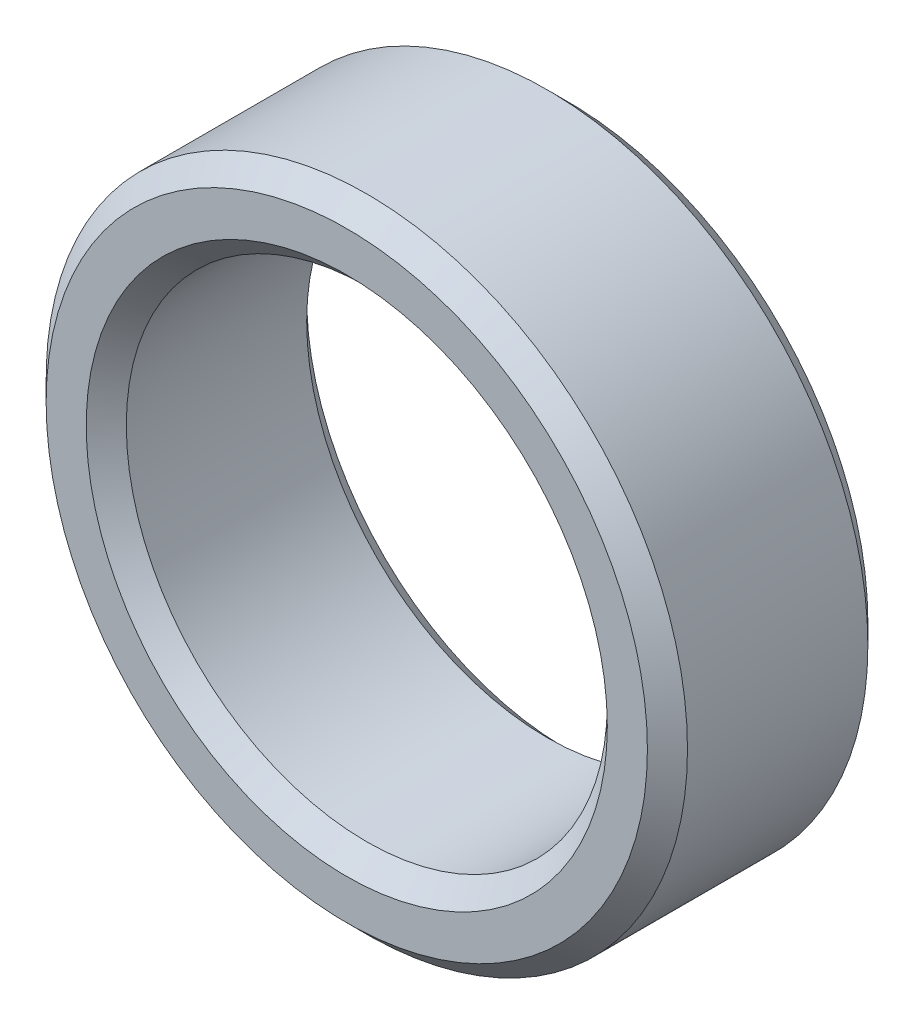
ISO-10303-21;
HEADER;
FILE_DESCRIPTION(('STEP AP214'),'2;1');
FILE_NAME('part.step','',(''),(''),'','','');
FILE_SCHEMA(('AUTOMOTIVE_DESIGN { 1 0 10303 214 1 1 1 1 }'));
ENDSEC;
DATA;
#1=APPLICATION_CONTEXT('core data for automotive mechanical design processes');
#2=APPLICATION_PROTOCOL_DEFINITION('international standard','automotive_design',2000,#1);
#3=PRODUCT_CONTEXT('',#1,'mechanical');
#4=PRODUCT('Part','Part','',(#3));
#5=PRODUCT_RELATED_PRODUCT_CATEGORY('part','',(#4));
#6=PRODUCT_DEFINITION_FORMATION('','',#4);
#7=PRODUCT_DEFINITION_CONTEXT('part definition',#1,'design');
#8=PRODUCT_DEFINITION('design','',#6,#7);
#9=PRODUCT_DEFINITION_SHAPE('','',#8);
#10=(LENGTH_UNIT() NAMED_UNIT(*) SI_UNIT(.MILLI.,.METRE.));
#11=(NAMED_UNIT(*) PLANE_ANGLE_UNIT() SI_UNIT($,.RADIAN.));
#12=(NAMED_UNIT(*) SI_UNIT($,.STERADIAN.) SOLID_ANGLE_UNIT());
#13=UNCERTAINTY_MEASURE_WITH_UNIT(LENGTH_MEASURE(1.E-05),#10,'distance_accuracy_value','');
#14=(GEOMETRIC_REPRESENTATION_CONTEXT(3) GLOBAL_UNCERTAINTY_ASSIGNED_CONTEXT((#13)) GLOBAL_UNIT_ASSIGNED_CONTEXT((#10,
#11,#12)) REPRESENTATION_CONTEXT('',''));
#15=CARTESIAN_POINT('',(0.,0.,0.));
#16=DIRECTION('',(0.,0.,1.));
#17=DIRECTION('',(1.,0.,0.));
#18=AXIS2_PLACEMENT_3D('',#15,#16,#17);
#19=CARTESIAN_POINT('',(0.,0.,5.5));
#20=DIRECTION('',(0.,0.,1.));
#21=DIRECTION('',(1.,0.,0.));
#22=AXIS2_PLACEMENT_3D('',#19,#20,#21);
#23=PLANE('',#22);
#24=CARTESIAN_POINT('',(0.,0.,5.5));
#25=DIRECTION('',(0.,0.,1.));
#26=DIRECTION('',(1.,0.,0.));
#27=AXIS2_PLACEMENT_3D('',#24,#25,#26);
#28=CIRCLE('',#27,6.50000000000001);
#29=CARTESIAN_POINT('',(6.50000000000001,0.,5.5));
#30=VERTEX_POINT('',#29);
#31=EDGE_CURVE('E50',#30,#30,#28,.F.);
#32=ORIENTED_EDGE('',*,*,#31,.T.);
#33=EDGE_LOOP('',(#32));
#34=FACE_BOUND('',#33,.T.);
#35=CARTESIAN_POINT('',(0.,0.,5.5));
#36=DIRECTION('',(0.,0.,1.));
#37=DIRECTION('',(1.,0.,0.));
#38=AXIS2_PLACEMENT_3D('',#35,#36,#37);
#39=CIRCLE('',#38,7.5);
#40=CARTESIAN_POINT('',(7.5,0.,5.5));
#41=VERTEX_POINT('',#40);
#42=EDGE_CURVE('E53',#41,#41,#39,.T.);
#43=ORIENTED_EDGE('',*,*,#42,.T.);
#44=EDGE_LOOP('',(#43));
#45=FACE_BOUND('',#44,.T.);
#46=ADVANCED_FACE('F30',(#34,#45),#23,.T.);
#47=CARTESIAN_POINT('',(0.,0.,0.));
#48=DIRECTION('',(0.,0.,1.));
#49=DIRECTION('',(1.,0.,0.));
#50=AXIS2_PLACEMENT_3D('',#47,#48,#49);
#51=PLANE('',#50);
#52=CARTESIAN_POINT('',(0.,0.,0.));
#53=DIRECTION('',(0.,0.,1.));
#54=DIRECTION('',(1.,0.,0.));
#55=AXIS2_PLACEMENT_3D('',#52,#53,#54);
#56=CIRCLE('',#55,6.5);
#57=CARTESIAN_POINT('',(6.5,0.,0.));
#58=VERTEX_POINT('',#57);
#59=EDGE_CURVE('E10',#58,#58,#56,.T.);
#60=ORIENTED_EDGE('',*,*,#59,.T.);
#61=EDGE_LOOP('',(#60));
#62=FACE_BOUND('',#61,.T.);
#63=CARTESIAN_POINT('',(0.,0.,0.));
#64=DIRECTION('',(0.,0.,1.));
#65=DIRECTION('',(1.,0.,0.));
#66=AXIS2_PLACEMENT_3D('',#63,#64,#65);
#67=CIRCLE('',#66,7.5);
#68=CARTESIAN_POINT('',(7.5,0.,0.));
#69=VERTEX_POINT('',#68);
#70=EDGE_CURVE('E37',#69,#69,#67,.F.);
#71=ORIENTED_EDGE('',*,*,#70,.T.);
#72=EDGE_LOOP('',(#71));
#73=FACE_BOUND('',#72,.T.);
#74=ADVANCED_FACE('F78',(#62,#73),#51,.F.);
#75=CARTESIAN_POINT('',(0.,0.,5.5));
#76=DIRECTION('',(0.,0.,-1.));
#77=DIRECTION('',(-1.,0.,0.));
#78=AXIS2_PLACEMENT_3D('',#75,#76,#77);
#79=CYLINDRICAL_SURFACE('',#78,8.);
#80=CARTESIAN_POINT('',(0.,0.,4.99999999999999));
#81=DIRECTION('',(0.,0.,1.));
#82=DIRECTION('',(1.,0.,0.));
#83=AXIS2_PLACEMENT_3D('',#80,#81,#82);
#84=CIRCLE('',#83,8.);
#85=CARTESIAN_POINT('',(8.,0.,4.99999999999999));
#86=VERTEX_POINT('',#85);
#87=EDGE_CURVE('E41',#86,#86,#84,.F.);
#88=ORIENTED_EDGE('',*,*,#87,.T.);
#89=EDGE_LOOP('',(#88));
#90=FACE_BOUND('',#89,.T.);
#91=CARTESIAN_POINT('',(0.,0.,0.5));
#92=DIRECTION('',(0.,0.,1.));
#93=DIRECTION('',(1.,0.,0.));
#94=AXIS2_PLACEMENT_3D('',#91,#92,#93);
#95=CIRCLE('',#94,8.);
#96=CARTESIAN_POINT('',(8.,0.,0.5));
#97=VERTEX_POINT('',#96);
#98=EDGE_CURVE('E45',#97,#97,#95,.T.);
#99=ORIENTED_EDGE('',*,*,#98,.T.);
#100=EDGE_LOOP('',(#99));
#101=FACE_BOUND('',#100,.T.);
#102=ADVANCED_FACE('F84',(#90,#101),#79,.T.);
#103=CARTESIAN_POINT('',(0.,0.,5.5));
#104=DIRECTION('',(0.,0.,-1.));
#105=DIRECTION('',(-1.,0.,0.));
#106=AXIS2_PLACEMENT_3D('',#103,#104,#105);
#107=CYLINDRICAL_SURFACE('',#106,6.);
#108=CARTESIAN_POINT('',(0.,0.,4.99999999999999));
#109=DIRECTION('',(0.,0.,1.));
#110=DIRECTION('',(1.,0.,0.));
#111=AXIS2_PLACEMENT_3D('',#108,#109,#110);
#112=CIRCLE('',#111,6.);
#113=CARTESIAN_POINT('',(6.,0.,4.99999999999999));
#114=VERTEX_POINT('',#113);
#115=EDGE_CURVE('E56',#114,#114,#112,.T.);
#116=ORIENTED_EDGE('',*,*,#115,.T.);
#117=EDGE_LOOP('',(#116));
#118=FACE_BOUND('',#117,.T.);
#119=CARTESIAN_POINT('',(0.,0.,0.5));
#120=DIRECTION('',(0.,0.,1.));
#121=DIRECTION('',(1.,0.,0.));
#122=AXIS2_PLACEMENT_3D('',#119,#120,#121);
#123=CIRCLE('',#122,6.);
#124=CARTESIAN_POINT('',(6.,0.,0.5));
#125=VERTEX_POINT('',#124);
#126=EDGE_CURVE('E59',#125,#125,#123,.F.);
#127=ORIENTED_EDGE('',*,*,#126,.T.);
#128=EDGE_LOOP('',(#127));
#129=FACE_BOUND('',#128,.T.);
#130=ADVANCED_FACE('F63',(#118,#129),#107,.F.);
#131=CARTESIAN_POINT('',(0.,0.,4.99999999999999));
#132=DIRECTION('',(0.,0.,1.));
#133=DIRECTION('',(1.,0.,0.));
#134=AXIS2_PLACEMENT_3D('',#131,#132,#133);
#135=CONICAL_SURFACE('',#134,6.,0.785398163397449);
#136=ORIENTED_EDGE('',*,*,#31,.F.);
#137=EDGE_LOOP('',(#136));
#138=FACE_BOUND('',#137,.T.);
#139=ORIENTED_EDGE('',*,*,#115,.F.);
#140=EDGE_LOOP('',(#139));
#141=FACE_BOUND('',#140,.T.);
#142=ADVANCED_FACE('F74',(#138,#141),#135,.F.);
#143=CARTESIAN_POINT('',(0.,0.,5.5));
#144=DIRECTION('',(0.,0.,-1.));
#145=DIRECTION('',(-1.,0.,0.));
#146=AXIS2_PLACEMENT_3D('',#143,#144,#145);
#147=CONICAL_SURFACE('',#146,7.5,0.785398163397447);
#148=ORIENTED_EDGE('',*,*,#87,.F.);
#149=EDGE_LOOP('',(#148));
#150=FACE_BOUND('',#149,.T.);
#151=ORIENTED_EDGE('',*,*,#42,.F.);
#152=EDGE_LOOP('',(#151));
#153=FACE_BOUND('',#152,.T.);
#154=ADVANCED_FACE('F68',(#150,#153),#147,.T.);
#155=CARTESIAN_POINT('',(0.,0.,0.));
#156=DIRECTION('',(0.,0.,-1.));
#157=DIRECTION('',(-1.,0.,0.));
#158=AXIS2_PLACEMENT_3D('',#155,#156,#157);
#159=CONICAL_SURFACE('',#158,6.5,0.785398163397447);
#160=ORIENTED_EDGE('',*,*,#126,.F.);
#161=EDGE_LOOP('',(#160));
#162=FACE_BOUND('',#161,.T.);
#163=ORIENTED_EDGE('',*,*,#59,.F.);
#164=EDGE_LOOP('',(#163));
#165=FACE_BOUND('',#164,.T.);
#166=ADVANCED_FACE('F65',(#162,#165),#159,.F.);
#167=CARTESIAN_POINT('',(0.,0.,0.5));
#168=DIRECTION('',(0.,0.,1.));
#169=DIRECTION('',(1.,0.,0.));
#170=AXIS2_PLACEMENT_3D('',#167,#168,#169);
#171=CONICAL_SURFACE('',#170,8.,0.785398163397448);
#172=ORIENTED_EDGE('',*,*,#70,.F.);
#173=EDGE_LOOP('',(#172));
#174=FACE_BOUND('',#173,.T.);
#175=ORIENTED_EDGE('',*,*,#98,.F.);
#176=EDGE_LOOP('',(#175));
#177=FACE_BOUND('',#176,.T.);
#178=ADVANCED_FACE('F32',(#174,#177),#171,.T.);
#179=CLOSED_SHELL('',(#46,#74,#102,#130,#142,#154,#166,#178));
#180=MANIFOLD_SOLID_BREP('B2',#179);
#181=ADVANCED_BREP_SHAPE_REPRESENTATION('',(#18,#180),#14);
#182=SHAPE_DEFINITION_REPRESENTATION(#9,#181);
ENDSEC;
END-ISO-10303-21;
